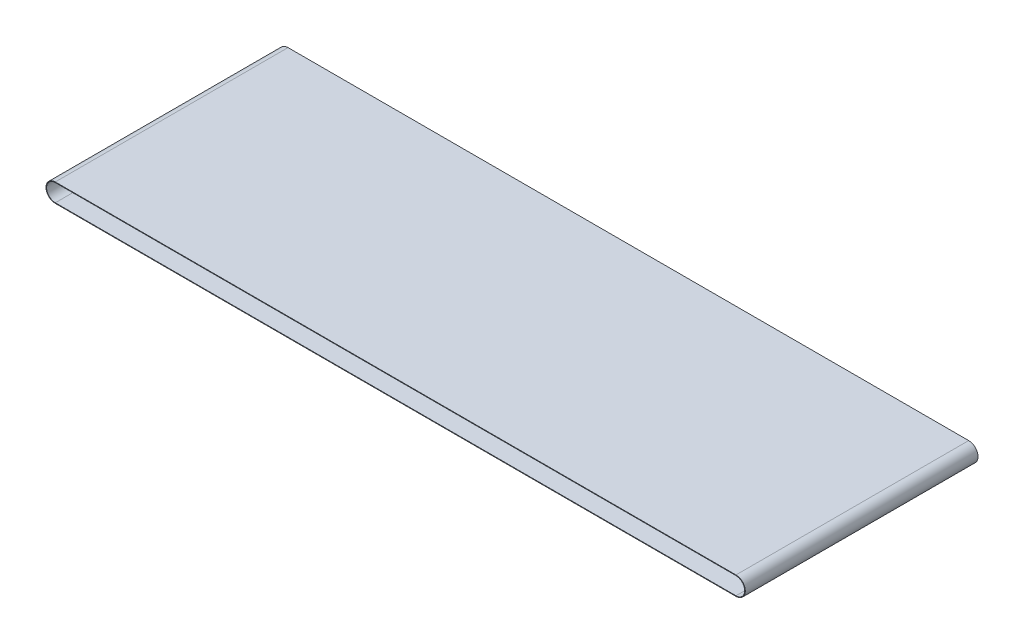
ISO-10303-21;
HEADER;
FILE_DESCRIPTION(('STEP AP214'),'2;1');
FILE_NAME('part.step','',(''),(''),'','','');
FILE_SCHEMA(('AUTOMOTIVE_DESIGN { 1 0 10303 214 1 1 1 1 }'));
ENDSEC;
DATA;
#1=APPLICATION_CONTEXT('core data for automotive mechanical design processes');
#2=APPLICATION_PROTOCOL_DEFINITION('international standard','automotive_design',2000,#1);
#3=PRODUCT_CONTEXT('',#1,'mechanical');
#4=PRODUCT('Part','Part','',(#3));
#5=PRODUCT_RELATED_PRODUCT_CATEGORY('part','',(#4));
#6=PRODUCT_DEFINITION_FORMATION('','',#4);
#7=PRODUCT_DEFINITION_CONTEXT('part definition',#1,'design');
#8=PRODUCT_DEFINITION('design','',#6,#7);
#9=PRODUCT_DEFINITION_SHAPE('','',#8);
#10=(LENGTH_UNIT() NAMED_UNIT(*) SI_UNIT(.MILLI.,.METRE.));
#11=(NAMED_UNIT(*) PLANE_ANGLE_UNIT() SI_UNIT($,.RADIAN.));
#12=(NAMED_UNIT(*) SI_UNIT($,.STERADIAN.) SOLID_ANGLE_UNIT());
#13=UNCERTAINTY_MEASURE_WITH_UNIT(LENGTH_MEASURE(1.E-05),#10,'distance_accuracy_value','');
#14=(GEOMETRIC_REPRESENTATION_CONTEXT(3) GLOBAL_UNCERTAINTY_ASSIGNED_CONTEXT((#13)) GLOBAL_UNIT_ASSIGNED_CONTEXT((#10,
#11,#12)) REPRESENTATION_CONTEXT('',''));
#15=CARTESIAN_POINT('',(0.,0.,0.));
#16=DIRECTION('',(0.,0.,1.));
#17=DIRECTION('',(1.,0.,0.));
#18=AXIS2_PLACEMENT_3D('',#15,#16,#17);
#19=CARTESIAN_POINT('',(-585.,-15.,200.));
#20=DIRECTION('',(0.,0.,1.));
#21=DIRECTION('',(1.,0.,0.));
#22=AXIS2_PLACEMENT_3D('',#19,#20,#21);
#23=PLANE('',#22);
#24=CARTESIAN_POINT('',(-585.,-15.,200.));
#25=DIRECTION('',(0.,0.,1.));
#26=DIRECTION('',(1.,0.,0.));
#27=AXIS2_PLACEMENT_3D('',#24,#25,#26);
#28=CIRCLE('',#27,15.9999999999999);
#29=CARTESIAN_POINT('',(-585.,1.,200.));
#30=VERTEX_POINT('',#29);
#31=CARTESIAN_POINT('',(-585.,-30.9999999999998,200.));
#32=VERTEX_POINT('',#31);
#33=EDGE_CURVE('E160',#30,#32,#28,.T.);
#34=ORIENTED_EDGE('',*,*,#33,.T.);
#35=DIRECTION('',(1.,0.,0.));
#36=VECTOR('',#35,1.);
#37=CARTESIAN_POINT('',(-585.,-30.9999999999998,200.));
#38=LINE('',#37,#36);
#39=CARTESIAN_POINT('',(585.,-30.9999999999997,200.));
#40=VERTEX_POINT('',#39);
#41=EDGE_CURVE('E163',#32,#40,#38,.T.);
#42=ORIENTED_EDGE('',*,*,#41,.T.);
#43=CARTESIAN_POINT('',(585.,-14.9999999999999,200.));
#44=DIRECTION('',(0.,0.,1.));
#45=DIRECTION('',(1.,0.,0.));
#46=AXIS2_PLACEMENT_3D('',#43,#44,#45);
#47=CIRCLE('',#46,15.9999999999999);
#48=CARTESIAN_POINT('',(585.,1.00000000000007,200.));
#49=VERTEX_POINT('',#48);
#50=EDGE_CURVE('E166',#40,#49,#47,.T.);
#51=ORIENTED_EDGE('',*,*,#50,.T.);
#52=DIRECTION('',(-1.,0.,0.));
#53=VECTOR('',#52,1.);
#54=CARTESIAN_POINT('',(-585.,1.,200.));
#55=LINE('',#54,#53);
#56=EDGE_CURVE('E168',#49,#30,#55,.T.);
#57=ORIENTED_EDGE('',*,*,#56,.T.);
#58=EDGE_LOOP('',(#34,#42,#51,#57));
#59=FACE_BOUND('',#58,.T.);
#60=DIRECTION('',(1.,0.,0.));
#61=VECTOR('',#60,1.);
#62=CARTESIAN_POINT('',(-585.,-29.9999999999998,200.));
#63=LINE('',#62,#61);
#64=CARTESIAN_POINT('',(-585.,-29.9999999999998,200.));
#65=VERTEX_POINT('',#64);
#66=CARTESIAN_POINT('',(585.,-29.9999999999998,200.));
#67=VERTEX_POINT('',#66);
#68=EDGE_CURVE('E132',#65,#67,#63,.T.);
#69=ORIENTED_EDGE('',*,*,#68,.F.);
#70=CARTESIAN_POINT('',(-585.,-15.,200.));
#71=DIRECTION('',(0.,0.,1.));
#72=DIRECTION('',(1.,0.,0.));
#73=AXIS2_PLACEMENT_3D('',#70,#71,#72);
#74=CIRCLE('',#73,14.9999999999999);
#75=CARTESIAN_POINT('',(-585.,0.,200.));
#76=VERTEX_POINT('',#75);
#77=EDGE_CURVE('E124',#76,#65,#74,.T.);
#78=ORIENTED_EDGE('',*,*,#77,.F.);
#79=DIRECTION('',(-1.,0.,0.));
#80=VECTOR('',#79,1.);
#81=CARTESIAN_POINT('',(-585.,0.,200.));
#82=LINE('',#81,#80);
#83=CARTESIAN_POINT('',(585.,1.4328367550024E-13,200.));
#84=VERTEX_POINT('',#83);
#85=EDGE_CURVE('E146',#84,#76,#82,.T.);
#86=ORIENTED_EDGE('',*,*,#85,.F.);
#87=CARTESIAN_POINT('',(585.,-14.9999999999999,200.));
#88=DIRECTION('',(0.,0.,1.));
#89=DIRECTION('',(-1.,0.,0.));
#90=AXIS2_PLACEMENT_3D('',#87,#88,#89);
#91=CIRCLE('',#90,14.9999999999999);
#92=EDGE_CURVE('E144',#67,#84,#91,.T.);
#93=ORIENTED_EDGE('',*,*,#92,.F.);
#94=EDGE_LOOP('',(#69,#78,#86,#93));
#95=FACE_BOUND('',#94,.T.);
#96=ADVANCED_FACE('F59',(#59,#95),#23,.T.);
#97=CARTESIAN_POINT('',(-585.,-15.,-200.));
#98=DIRECTION('',(0.,0.,1.));
#99=DIRECTION('',(1.,0.,0.));
#100=AXIS2_PLACEMENT_3D('',#97,#98,#99);
#101=PLANE('',#100);
#102=CARTESIAN_POINT('',(-585.,-15.,-200.));
#103=DIRECTION('',(0.,0.,1.));
#104=DIRECTION('',(1.,0.,0.));
#105=AXIS2_PLACEMENT_3D('',#102,#103,#104);
#106=CIRCLE('',#105,15.9999999999999);
#107=CARTESIAN_POINT('',(-585.,1.,-200.));
#108=VERTEX_POINT('',#107);
#109=CARTESIAN_POINT('',(-585.,-30.9999999999998,-200.));
#110=VERTEX_POINT('',#109);
#111=EDGE_CURVE('E140',#108,#110,#106,.T.);
#112=ORIENTED_EDGE('',*,*,#111,.F.);
#113=DIRECTION('',(-1.,0.,0.));
#114=VECTOR('',#113,1.);
#115=CARTESIAN_POINT('',(-585.,1.,-200.));
#116=LINE('',#115,#114);
#117=CARTESIAN_POINT('',(585.,1.00000000000007,-200.));
#118=VERTEX_POINT('',#117);
#119=EDGE_CURVE('E164',#118,#108,#116,.T.);
#120=ORIENTED_EDGE('',*,*,#119,.F.);
#121=CARTESIAN_POINT('',(585.,-14.9999999999999,-200.));
#122=DIRECTION('',(0.,0.,1.));
#123=DIRECTION('',(1.,0.,0.));
#124=AXIS2_PLACEMENT_3D('',#121,#122,#123);
#125=CIRCLE('',#124,15.9999999999999);
#126=CARTESIAN_POINT('',(585.,-30.9999999999997,-200.));
#127=VERTEX_POINT('',#126);
#128=EDGE_CURVE('E175',#127,#118,#125,.T.);
#129=ORIENTED_EDGE('',*,*,#128,.F.);
#130=DIRECTION('',(1.,0.,0.));
#131=VECTOR('',#130,1.);
#132=CARTESIAN_POINT('',(-585.,-30.9999999999998,-200.));
#133=LINE('',#132,#131);
#134=EDGE_CURVE('E173',#110,#127,#133,.T.);
#135=ORIENTED_EDGE('',*,*,#134,.F.);
#136=EDGE_LOOP('',(#112,#120,#129,#135));
#137=FACE_BOUND('',#136,.T.);
#138=CARTESIAN_POINT('',(-585.,-15.,-200.));
#139=DIRECTION('',(0.,0.,1.));
#140=DIRECTION('',(1.,0.,0.));
#141=AXIS2_PLACEMENT_3D('',#138,#139,#140);
#142=CIRCLE('',#141,14.9999999999999);
#143=CARTESIAN_POINT('',(-585.,0.,-200.));
#144=VERTEX_POINT('',#143);
#145=CARTESIAN_POINT('',(-585.,-29.9999999999998,-200.));
#146=VERTEX_POINT('',#145);
#147=EDGE_CURVE('E82',#144,#146,#142,.T.);
#148=ORIENTED_EDGE('',*,*,#147,.T.);
#149=DIRECTION('',(1.,0.,0.));
#150=VECTOR('',#149,1.);
#151=CARTESIAN_POINT('',(-585.,-29.9999999999998,-200.));
#152=LINE('',#151,#150);
#153=CARTESIAN_POINT('',(585.,-29.9999999999998,-200.));
#154=VERTEX_POINT('',#153);
#155=EDGE_CURVE('E139',#146,#154,#152,.T.);
#156=ORIENTED_EDGE('',*,*,#155,.T.);
#157=CARTESIAN_POINT('',(585.,-14.9999999999999,-200.));
#158=DIRECTION('',(0.,0.,1.));
#159=DIRECTION('',(-1.,0.,0.));
#160=AXIS2_PLACEMENT_3D('',#157,#158,#159);
#161=CIRCLE('',#160,14.9999999999999);
#162=CARTESIAN_POINT('',(585.,1.4328367550024E-13,-200.));
#163=VERTEX_POINT('',#162);
#164=EDGE_CURVE('E152',#154,#163,#161,.T.);
#165=ORIENTED_EDGE('',*,*,#164,.T.);
#166=DIRECTION('',(-1.,0.,0.));
#167=VECTOR('',#166,1.);
#168=CARTESIAN_POINT('',(-585.,0.,-200.));
#169=LINE('',#168,#167);
#170=EDGE_CURVE('E133',#163,#144,#169,.T.);
#171=ORIENTED_EDGE('',*,*,#170,.T.);
#172=EDGE_LOOP('',(#148,#156,#165,#171));
#173=FACE_BOUND('',#172,.T.);
#174=ADVANCED_FACE('F193',(#137,#173),#101,.F.);
#175=CARTESIAN_POINT('',(-585.,-15.,200.));
#176=DIRECTION('',(0.,0.,-1.));
#177=DIRECTION('',(-1.,0.,0.));
#178=AXIS2_PLACEMENT_3D('',#175,#176,#177);
#179=CYLINDRICAL_SURFACE('',#178,15.9999999999999);
#180=ORIENTED_EDGE('',*,*,#111,.T.);
#181=DIRECTION('',(0.,0.,-1.));
#182=VECTOR('',#181,1.);
#183=CARTESIAN_POINT('',(-585.,-30.9999999999998,200.));
#184=LINE('',#183,#182);
#185=EDGE_CURVE('E12',#32,#110,#184,.T.);
#186=ORIENTED_EDGE('',*,*,#185,.F.);
#187=ORIENTED_EDGE('',*,*,#33,.F.);
#188=DIRECTION('',(0.,0.,-1.));
#189=VECTOR('',#188,1.);
#190=CARTESIAN_POINT('',(-585.,1.,200.));
#191=LINE('',#190,#189);
#192=EDGE_CURVE('E170',#30,#108,#191,.T.);
#193=ORIENTED_EDGE('',*,*,#192,.T.);
#194=EDGE_LOOP('',(#180,#186,#187,#193));
#195=FACE_BOUND('',#194,.T.);
#196=ADVANCED_FACE('F61',(#195),#179,.T.);
#197=CARTESIAN_POINT('',(-585.,-30.9999999999998,200.));
#198=DIRECTION('',(0.,1.,0.));
#199=DIRECTION('',(-1.,0.,0.));
#200=AXIS2_PLACEMENT_3D('',#197,#198,#199);
#201=PLANE('',#200);
#202=ORIENTED_EDGE('',*,*,#134,.T.);
#203=DIRECTION('',(0.,0.,-1.));
#204=VECTOR('',#203,1.);
#205=CARTESIAN_POINT('',(585.,-30.9999999999997,200.));
#206=LINE('',#205,#204);
#207=EDGE_CURVE('E67',#40,#127,#206,.T.);
#208=ORIENTED_EDGE('',*,*,#207,.F.);
#209=ORIENTED_EDGE('',*,*,#41,.F.);
#210=ORIENTED_EDGE('',*,*,#185,.T.);
#211=EDGE_LOOP('',(#202,#208,#209,#210));
#212=FACE_BOUND('',#211,.T.);
#213=ADVANCED_FACE('F203',(#212),#201,.F.);
#214=CARTESIAN_POINT('',(585.,-14.9999999999999,200.));
#215=DIRECTION('',(0.,0.,-1.));
#216=DIRECTION('',(-1.,0.,0.));
#217=AXIS2_PLACEMENT_3D('',#214,#215,#216);
#218=CYLINDRICAL_SURFACE('',#217,15.9999999999999);
#219=ORIENTED_EDGE('',*,*,#128,.T.);
#220=DIRECTION('',(0.,0.,-1.));
#221=VECTOR('',#220,1.);
#222=CARTESIAN_POINT('',(585.,1.00000000000007,200.));
#223=LINE('',#222,#221);
#224=EDGE_CURVE('E180',#49,#118,#223,.T.);
#225=ORIENTED_EDGE('',*,*,#224,.F.);
#226=ORIENTED_EDGE('',*,*,#50,.F.);
#227=ORIENTED_EDGE('',*,*,#207,.T.);
#228=EDGE_LOOP('',(#219,#225,#226,#227));
#229=FACE_BOUND('',#228,.T.);
#230=ADVANCED_FACE('F187',(#229),#218,.T.);
#231=CARTESIAN_POINT('',(-585.,1.,200.));
#232=DIRECTION('',(0.,-1.,0.));
#233=DIRECTION('',(1.,0.,0.));
#234=AXIS2_PLACEMENT_3D('',#231,#232,#233);
#235=PLANE('',#234);
#236=ORIENTED_EDGE('',*,*,#119,.T.);
#237=ORIENTED_EDGE('',*,*,#192,.F.);
#238=ORIENTED_EDGE('',*,*,#56,.F.);
#239=ORIENTED_EDGE('',*,*,#224,.T.);
#240=EDGE_LOOP('',(#236,#237,#238,#239));
#241=FACE_BOUND('',#240,.T.);
#242=ADVANCED_FACE('F197',(#241),#235,.F.);
#243=CARTESIAN_POINT('',(-585.,-15.,200.));
#244=DIRECTION('',(0.,0.,-1.));
#245=DIRECTION('',(-1.,0.,0.));
#246=AXIS2_PLACEMENT_3D('',#243,#244,#245);
#247=CYLINDRICAL_SURFACE('',#246,14.9999999999999);
#248=ORIENTED_EDGE('',*,*,#147,.F.);
#249=DIRECTION('',(0.,0.,-1.));
#250=VECTOR('',#249,1.);
#251=CARTESIAN_POINT('',(-585.,0.,200.));
#252=LINE('',#251,#250);
#253=EDGE_CURVE('E128',#76,#144,#252,.T.);
#254=ORIENTED_EDGE('',*,*,#253,.F.);
#255=ORIENTED_EDGE('',*,*,#77,.T.);
#256=DIRECTION('',(0.,0.,-1.));
#257=VECTOR('',#256,1.);
#258=CARTESIAN_POINT('',(-585.,-29.9999999999998,200.));
#259=LINE('',#258,#257);
#260=EDGE_CURVE('E127',#65,#146,#259,.T.);
#261=ORIENTED_EDGE('',*,*,#260,.T.);
#262=EDGE_LOOP('',(#248,#254,#255,#261));
#263=FACE_BOUND('',#262,.T.);
#264=ADVANCED_FACE('F126',(#263),#247,.F.);
#265=CARTESIAN_POINT('',(-585.,-29.9999999999998,200.));
#266=DIRECTION('',(0.,1.,0.));
#267=DIRECTION('',(-1.,0.,0.));
#268=AXIS2_PLACEMENT_3D('',#265,#266,#267);
#269=PLANE('',#268);
#270=ORIENTED_EDGE('',*,*,#155,.F.);
#271=ORIENTED_EDGE('',*,*,#260,.F.);
#272=ORIENTED_EDGE('',*,*,#68,.T.);
#273=DIRECTION('',(0.,0.,-1.));
#274=VECTOR('',#273,1.);
#275=CARTESIAN_POINT('',(585.,-29.9999999999998,200.));
#276=LINE('',#275,#274);
#277=EDGE_CURVE('E141',#67,#154,#276,.T.);
#278=ORIENTED_EDGE('',*,*,#277,.T.);
#279=EDGE_LOOP('',(#270,#271,#272,#278));
#280=FACE_BOUND('',#279,.T.);
#281=ADVANCED_FACE('F136',(#280),#269,.T.);
#282=CARTESIAN_POINT('',(585.,-14.9999999999999,200.));
#283=DIRECTION('',(0.,0.,-1.));
#284=DIRECTION('',(-1.,0.,0.));
#285=AXIS2_PLACEMENT_3D('',#282,#283,#284);
#286=CYLINDRICAL_SURFACE('',#285,14.9999999999999);
#287=ORIENTED_EDGE('',*,*,#164,.F.);
#288=ORIENTED_EDGE('',*,*,#277,.F.);
#289=ORIENTED_EDGE('',*,*,#92,.T.);
#290=DIRECTION('',(0.,0.,-1.));
#291=VECTOR('',#290,1.);
#292=CARTESIAN_POINT('',(585.,1.4328367550024E-13,200.));
#293=LINE('',#292,#291);
#294=EDGE_CURVE('E74',#84,#163,#293,.T.);
#295=ORIENTED_EDGE('',*,*,#294,.T.);
#296=EDGE_LOOP('',(#287,#288,#289,#295));
#297=FACE_BOUND('',#296,.T.);
#298=ADVANCED_FACE('F226',(#297),#286,.F.);
#299=CARTESIAN_POINT('',(-585.,0.,200.));
#300=DIRECTION('',(0.,-1.,0.));
#301=DIRECTION('',(1.,0.,0.));
#302=AXIS2_PLACEMENT_3D('',#299,#300,#301);
#303=PLANE('',#302);
#304=ORIENTED_EDGE('',*,*,#170,.F.);
#305=ORIENTED_EDGE('',*,*,#294,.F.);
#306=ORIENTED_EDGE('',*,*,#85,.T.);
#307=ORIENTED_EDGE('',*,*,#253,.T.);
#308=EDGE_LOOP('',(#304,#305,#306,#307));
#309=FACE_BOUND('',#308,.T.);
#310=ADVANCED_FACE('F230',(#309),#303,.T.);
#311=CLOSED_SHELL('',(#96,#174,#196,#213,#230,#242,#264,#281,#298,#310));
#312=MANIFOLD_SOLID_BREP('B2',#311);
#313=ADVANCED_BREP_SHAPE_REPRESENTATION('',(#18,#312),#14);
#314=SHAPE_DEFINITION_REPRESENTATION(#9,#313);
ENDSEC;
END-ISO-10303-21;
